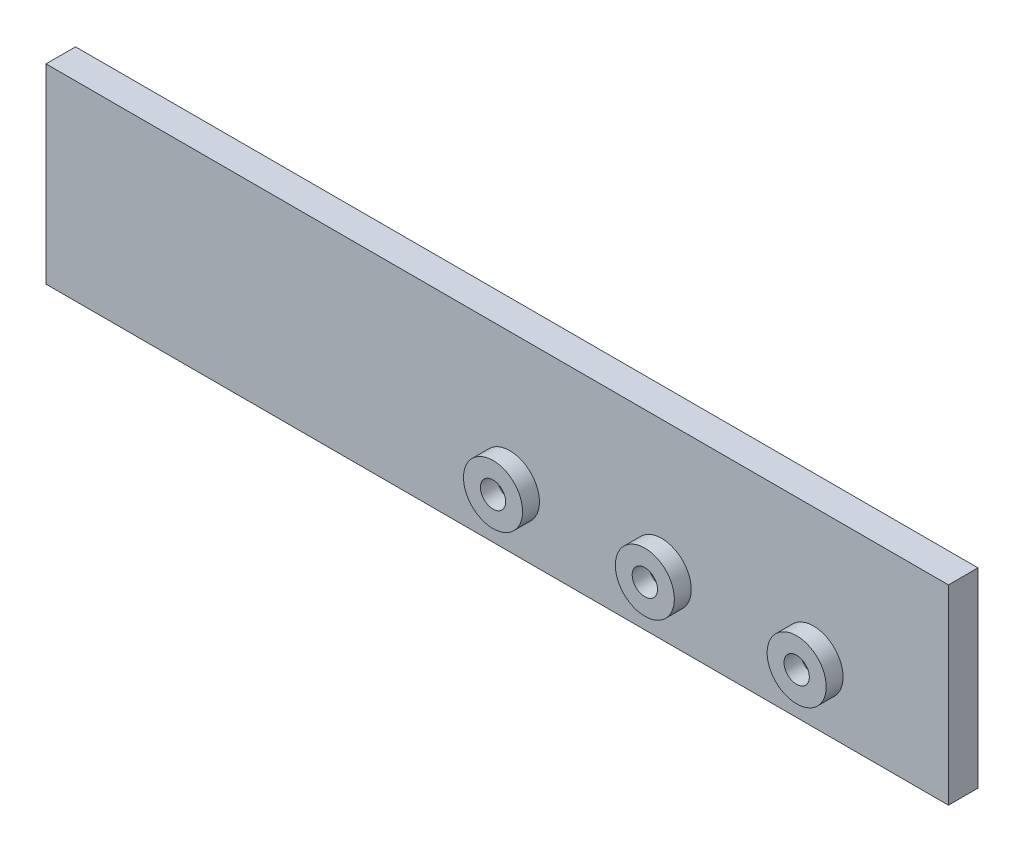
ISO-10303-21;
HEADER;
FILE_DESCRIPTION(('STEP AP214'),'2;1');
FILE_NAME('part.step','',(''),(''),'','','');
FILE_SCHEMA(('AUTOMOTIVE_DESIGN { 1 0 10303 214 1 1 1 1 }'));
ENDSEC;
DATA;
#1=APPLICATION_CONTEXT('core data for automotive mechanical design processes');
#2=APPLICATION_PROTOCOL_DEFINITION('international standard','automotive_design',2000,#1);
#3=PRODUCT_CONTEXT('',#1,'mechanical');
#4=PRODUCT('Part','Part','',(#3));
#5=PRODUCT_RELATED_PRODUCT_CATEGORY('part','',(#4));
#6=PRODUCT_DEFINITION_FORMATION('','',#4);
#7=PRODUCT_DEFINITION_CONTEXT('part definition',#1,'design');
#8=PRODUCT_DEFINITION('design','',#6,#7);
#9=PRODUCT_DEFINITION_SHAPE('','',#8);
#10=(LENGTH_UNIT() NAMED_UNIT(*) SI_UNIT(.MILLI.,.METRE.));
#11=(NAMED_UNIT(*) PLANE_ANGLE_UNIT() SI_UNIT($,.RADIAN.));
#12=(NAMED_UNIT(*) SI_UNIT($,.STERADIAN.) SOLID_ANGLE_UNIT());
#13=UNCERTAINTY_MEASURE_WITH_UNIT(LENGTH_MEASURE(1.E-05),#10,'distance_accuracy_value','');
#14=(GEOMETRIC_REPRESENTATION_CONTEXT(3) GLOBAL_UNCERTAINTY_ASSIGNED_CONTEXT((#13)) GLOBAL_UNIT_ASSIGNED_CONTEXT((#10,
#11,#12)) REPRESENTATION_CONTEXT('',''));
#15=CARTESIAN_POINT('',(0.,0.,0.));
#16=DIRECTION('',(0.,0.,1.));
#17=DIRECTION('',(1.,0.,0.));
#18=AXIS2_PLACEMENT_3D('',#15,#16,#17);
#19=CARTESIAN_POINT('',(0.,33.271694214876,3.5));
#20=DIRECTION('',(0.,1.,0.));
#21=DIRECTION('',(0.,0.,1.));
#22=AXIS2_PLACEMENT_3D('',#19,#20,#21);
#23=PLANE('',#22);
#24=DIRECTION('',(1.,0.,0.));
#25=VECTOR('',#24,1.);
#26=CARTESIAN_POINT('',(0.,33.271694214876,0.));
#27=LINE('',#26,#25);
#28=CARTESIAN_POINT('',(-40.6776859504132,33.271694214876,0.));
#29=VERTEX_POINT('',#28);
#30=CARTESIAN_POINT('',(66.3223140495868,33.271694214876,0.));
#31=VERTEX_POINT('',#30);
#32=EDGE_CURVE('E134',#29,#31,#27,.T.);
#33=ORIENTED_EDGE('',*,*,#32,.F.);
#34=DIRECTION('',(0.,0.,-1.));
#35=VECTOR('',#34,1.);
#36=CARTESIAN_POINT('',(-40.6776859504132,33.271694214876,3.5));
#37=LINE('',#36,#35);
#38=CARTESIAN_POINT('',(-40.6776859504132,33.271694214876,3.5));
#39=VERTEX_POINT('',#38);
#40=EDGE_CURVE('E129',#39,#29,#37,.T.);
#41=ORIENTED_EDGE('',*,*,#40,.F.);
#42=DIRECTION('',(1.,0.,0.));
#43=VECTOR('',#42,1.);
#44=CARTESIAN_POINT('',(0.,33.271694214876,3.5));
#45=LINE('',#44,#43);
#46=CARTESIAN_POINT('',(66.3223140495868,33.271694214876,3.5));
#47=VERTEX_POINT('',#46);
#48=EDGE_CURVE('E132',#39,#47,#45,.T.);
#49=ORIENTED_EDGE('',*,*,#48,.T.);
#50=DIRECTION('',(0.,0.,-1.));
#51=VECTOR('',#50,1.);
#52=CARTESIAN_POINT('',(66.3223140495868,33.271694214876,3.5));
#53=LINE('',#52,#51);
#54=EDGE_CURVE('E124',#47,#31,#53,.T.);
#55=ORIENTED_EDGE('',*,*,#54,.T.);
#56=EDGE_LOOP('',(#33,#41,#49,#55));
#57=FACE_BOUND('',#56,.T.);
#58=ADVANCED_FACE('F80',(#57),#23,.T.);
#59=CARTESIAN_POINT('',(-40.6776859504132,0.,3.5));
#60=DIRECTION('',(1.,0.,0.));
#61=DIRECTION('',(0.,1.,0.));
#62=AXIS2_PLACEMENT_3D('',#59,#60,#61);
#63=PLANE('',#62);
#64=DIRECTION('',(0.,-1.,0.));
#65=VECTOR('',#64,1.);
#66=CARTESIAN_POINT('',(-40.6776859504132,0.,0.));
#67=LINE('',#66,#65);
#68=CARTESIAN_POINT('',(-40.6776859504132,10.651694214876,0.));
#69=VERTEX_POINT('',#68);
#70=EDGE_CURVE('E154',#29,#69,#67,.T.);
#71=ORIENTED_EDGE('',*,*,#70,.T.);
#72=DIRECTION('',(0.,0.,-1.));
#73=VECTOR('',#72,1.);
#74=CARTESIAN_POINT('',(-40.6776859504132,10.651694214876,3.5));
#75=LINE('',#74,#73);
#76=CARTESIAN_POINT('',(-40.6776859504132,10.651694214876,3.5));
#77=VERTEX_POINT('',#76);
#78=EDGE_CURVE('E137',#77,#69,#75,.T.);
#79=ORIENTED_EDGE('',*,*,#78,.F.);
#80=DIRECTION('',(0.,-1.,0.));
#81=VECTOR('',#80,1.);
#82=CARTESIAN_POINT('',(-40.6776859504132,0.,3.5));
#83=LINE('',#82,#81);
#84=EDGE_CURVE('E140',#39,#77,#83,.T.);
#85=ORIENTED_EDGE('',*,*,#84,.F.);
#86=ORIENTED_EDGE('',*,*,#40,.T.);
#87=EDGE_LOOP('',(#71,#79,#85,#86));
#88=FACE_BOUND('',#87,.T.);
#89=ADVANCED_FACE('F141',(#88),#63,.F.);
#90=CARTESIAN_POINT('',(0.,10.651694214876,3.5));
#91=DIRECTION('',(0.,1.,0.));
#92=DIRECTION('',(0.,0.,1.));
#93=AXIS2_PLACEMENT_3D('',#90,#91,#92);
#94=PLANE('',#93);
#95=DIRECTION('',(1.,0.,0.));
#96=VECTOR('',#95,1.);
#97=CARTESIAN_POINT('',(0.,10.651694214876,0.));
#98=LINE('',#97,#96);
#99=CARTESIAN_POINT('',(66.3223140495868,10.651694214876,0.));
#100=VERTEX_POINT('',#99);
#101=EDGE_CURVE('E114',#69,#100,#98,.T.);
#102=ORIENTED_EDGE('',*,*,#101,.T.);
#103=DIRECTION('',(0.,0.,-1.));
#104=VECTOR('',#103,1.);
#105=CARTESIAN_POINT('',(66.3223140495868,10.651694214876,3.5));
#106=LINE('',#105,#104);
#107=CARTESIAN_POINT('',(66.3223140495868,10.651694214876,3.5));
#108=VERTEX_POINT('',#107);
#109=EDGE_CURVE('E121',#108,#100,#106,.T.);
#110=ORIENTED_EDGE('',*,*,#109,.F.);
#111=DIRECTION('',(1.,0.,0.));
#112=VECTOR('',#111,1.);
#113=CARTESIAN_POINT('',(0.,10.651694214876,3.5));
#114=LINE('',#113,#112);
#115=EDGE_CURVE('E97',#77,#108,#114,.T.);
#116=ORIENTED_EDGE('',*,*,#115,.F.);
#117=ORIENTED_EDGE('',*,*,#78,.T.);
#118=EDGE_LOOP('',(#102,#110,#116,#117));
#119=FACE_BOUND('',#118,.T.);
#120=ADVANCED_FACE('F223',(#119),#94,.F.);
#121=CARTESIAN_POINT('',(66.3223140495868,0.,3.5));
#122=DIRECTION('',(1.,0.,0.));
#123=DIRECTION('',(0.,1.,0.));
#124=AXIS2_PLACEMENT_3D('',#121,#122,#123);
#125=PLANE('',#124);
#126=DIRECTION('',(0.,-1.,0.));
#127=VECTOR('',#126,1.);
#128=CARTESIAN_POINT('',(66.3223140495868,0.,0.));
#129=LINE('',#128,#127);
#130=EDGE_CURVE('E150',#31,#100,#129,.T.);
#131=ORIENTED_EDGE('',*,*,#130,.F.);
#132=ORIENTED_EDGE('',*,*,#54,.F.);
#133=DIRECTION('',(0.,-1.,0.));
#134=VECTOR('',#133,1.);
#135=CARTESIAN_POINT('',(66.3223140495868,0.,3.5));
#136=LINE('',#135,#134);
#137=EDGE_CURVE('E144',#47,#108,#136,.T.);
#138=ORIENTED_EDGE('',*,*,#137,.T.);
#139=ORIENTED_EDGE('',*,*,#109,.T.);
#140=EDGE_LOOP('',(#131,#132,#138,#139));
#141=FACE_BOUND('',#140,.T.);
#142=ADVANCED_FACE('F82',(#141),#125,.T.);
#143=CARTESIAN_POINT('',(0.,0.,0.));
#144=DIRECTION('',(0.,0.,1.));
#145=DIRECTION('',(1.,0.,0.));
#146=AXIS2_PLACEMENT_3D('',#143,#144,#145);
#147=PLANE('',#146);
#148=ORIENTED_EDGE('',*,*,#130,.T.);
#149=ORIENTED_EDGE('',*,*,#101,.F.);
#150=ORIENTED_EDGE('',*,*,#70,.F.);
#151=ORIENTED_EDGE('',*,*,#32,.T.);
#152=EDGE_LOOP('',(#148,#149,#150,#151));
#153=FACE_BOUND('',#152,.T.);
#154=ADVANCED_FACE('F215',(#153),#147,.F.);
#155=CARTESIAN_POINT('',(0.,0.,3.5));
#156=DIRECTION('',(0.,0.,1.));
#157=DIRECTION('',(1.,0.,0.));
#158=AXIS2_PLACEMENT_3D('',#155,#156,#157);
#159=PLANE('',#158);
#160=CARTESIAN_POINT('',(50.3223140495868,17.551694214876,3.5));
#161=DIRECTION('',(0.,0.,1.));
#162=DIRECTION('',(1.,0.,0.));
#163=AXIS2_PLACEMENT_3D('',#160,#161,#162);
#164=CIRCLE('',#163,3.5);
#165=CARTESIAN_POINT('',(53.8223140495868,17.551694214876,3.5));
#166=VERTEX_POINT('',#165);
#167=EDGE_CURVE('E168',#166,#166,#164,.F.);
#168=ORIENTED_EDGE('',*,*,#167,.T.);
#169=EDGE_LOOP('',(#168));
#170=FACE_BOUND('',#169,.T.);
#171=CARTESIAN_POINT('',(32.3223140495868,17.551694214876,3.5));
#172=DIRECTION('',(0.,0.,1.));
#173=DIRECTION('',(1.,0.,0.));
#174=AXIS2_PLACEMENT_3D('',#171,#172,#173);
#175=CIRCLE('',#174,3.49999999999999);
#176=CARTESIAN_POINT('',(35.8223140495868,17.551694214876,3.5));
#177=VERTEX_POINT('',#176);
#178=EDGE_CURVE('E164',#177,#177,#175,.F.);
#179=ORIENTED_EDGE('',*,*,#178,.T.);
#180=EDGE_LOOP('',(#179));
#181=FACE_BOUND('',#180,.T.);
#182=CARTESIAN_POINT('',(14.3223140495868,17.551694214876,3.5));
#183=DIRECTION('',(0.,0.,1.));
#184=DIRECTION('',(1.,0.,0.));
#185=AXIS2_PLACEMENT_3D('',#182,#183,#184);
#186=CIRCLE('',#185,3.5);
#187=CARTESIAN_POINT('',(17.8223140495868,17.551694214876,3.5));
#188=VERTEX_POINT('',#187);
#189=EDGE_CURVE('E152',#188,#188,#186,.F.);
#190=ORIENTED_EDGE('',*,*,#189,.T.);
#191=EDGE_LOOP('',(#190));
#192=FACE_BOUND('',#191,.T.);
#193=ORIENTED_EDGE('',*,*,#137,.F.);
#194=ORIENTED_EDGE('',*,*,#48,.F.);
#195=ORIENTED_EDGE('',*,*,#84,.T.);
#196=ORIENTED_EDGE('',*,*,#115,.T.);
#197=EDGE_LOOP('',(#193,#194,#195,#196));
#198=FACE_BOUND('',#197,.T.);
#199=ADVANCED_FACE('F143',(#170,#181,#192,#198),#159,.T.);
#200=CARTESIAN_POINT('',(14.3223140495868,17.551694214876,5.5));
#201=DIRECTION('',(0.,0.,-1.));
#202=DIRECTION('',(-1.,0.,0.));
#203=AXIS2_PLACEMENT_3D('',#200,#201,#202);
#204=CYLINDRICAL_SURFACE('',#203,3.5);
#205=ORIENTED_EDGE('',*,*,#189,.F.);
#206=EDGE_LOOP('',(#205));
#207=FACE_BOUND('',#206,.T.);
#208=CARTESIAN_POINT('',(14.3223140495868,17.551694214876,5.5));
#209=DIRECTION('',(0.,0.,1.));
#210=DIRECTION('',(1.,0.,0.));
#211=AXIS2_PLACEMENT_3D('',#208,#209,#210);
#212=CIRCLE('',#211,3.5);
#213=CARTESIAN_POINT('',(17.8223140495868,17.551694214876,5.5));
#214=VERTEX_POINT('',#213);
#215=EDGE_CURVE('E163',#214,#214,#212,.T.);
#216=ORIENTED_EDGE('',*,*,#215,.F.);
#217=EDGE_LOOP('',(#216));
#218=FACE_BOUND('',#217,.T.);
#219=ADVANCED_FACE('F204',(#207,#218),#204,.T.);
#220=CARTESIAN_POINT('',(14.3223140495868,17.551694214876,5.5));
#221=DIRECTION('',(0.,0.,1.));
#222=DIRECTION('',(1.,0.,0.));
#223=AXIS2_PLACEMENT_3D('',#220,#221,#222);
#224=PLANE('',#223);
#225=CARTESIAN_POINT('',(14.3223140495868,17.551694214876,5.5));
#226=DIRECTION('',(0.,0.,1.));
#227=DIRECTION('',(1.,0.,0.));
#228=AXIS2_PLACEMENT_3D('',#225,#226,#227);
#229=CIRCLE('',#228,1.5);
#230=CARTESIAN_POINT('',(15.8223140495868,17.551694214876,5.5));
#231=VERTEX_POINT('',#230);
#232=EDGE_CURVE('E188',#231,#231,#229,.T.);
#233=ORIENTED_EDGE('',*,*,#232,.F.);
#234=EDGE_LOOP('',(#233));
#235=FACE_BOUND('',#234,.T.);
#236=ORIENTED_EDGE('',*,*,#215,.T.);
#237=EDGE_LOOP('',(#236));
#238=FACE_BOUND('',#237,.T.);
#239=ADVANCED_FACE('F202',(#235,#238),#224,.T.);
#240=CARTESIAN_POINT('',(32.3223140495868,17.551694214876,5.5));
#241=DIRECTION('',(0.,0.,-1.));
#242=DIRECTION('',(-1.,0.,0.));
#243=AXIS2_PLACEMENT_3D('',#240,#241,#242);
#244=CYLINDRICAL_SURFACE('',#243,3.49999999999999);
#245=ORIENTED_EDGE('',*,*,#178,.F.);
#246=EDGE_LOOP('',(#245));
#247=FACE_BOUND('',#246,.T.);
#248=CARTESIAN_POINT('',(32.3223140495868,17.551694214876,5.5));
#249=DIRECTION('',(0.,0.,1.));
#250=DIRECTION('',(1.,0.,0.));
#251=AXIS2_PLACEMENT_3D('',#248,#249,#250);
#252=CIRCLE('',#251,3.49999999999999);
#253=CARTESIAN_POINT('',(35.8223140495868,17.551694214876,5.5));
#254=VERTEX_POINT('',#253);
#255=EDGE_CURVE('E167',#254,#254,#252,.T.);
#256=ORIENTED_EDGE('',*,*,#255,.F.);
#257=EDGE_LOOP('',(#256));
#258=FACE_BOUND('',#257,.T.);
#259=ADVANCED_FACE('F212',(#247,#258),#244,.T.);
#260=CARTESIAN_POINT('',(32.3223140495868,17.551694214876,5.5));
#261=DIRECTION('',(0.,0.,1.));
#262=DIRECTION('',(1.,0.,0.));
#263=AXIS2_PLACEMENT_3D('',#260,#261,#262);
#264=PLANE('',#263);
#265=CARTESIAN_POINT('',(32.3223140495868,17.551694214876,5.5));
#266=DIRECTION('',(0.,0.,1.));
#267=DIRECTION('',(1.,0.,0.));
#268=AXIS2_PLACEMENT_3D('',#265,#266,#267);
#269=CIRCLE('',#268,1.5);
#270=CARTESIAN_POINT('',(33.8223140495868,17.551694214876,5.5));
#271=VERTEX_POINT('',#270);
#272=EDGE_CURVE('E186',#271,#271,#269,.T.);
#273=ORIENTED_EDGE('',*,*,#272,.F.);
#274=EDGE_LOOP('',(#273));
#275=FACE_BOUND('',#274,.T.);
#276=ORIENTED_EDGE('',*,*,#255,.T.);
#277=EDGE_LOOP('',(#276));
#278=FACE_BOUND('',#277,.T.);
#279=ADVANCED_FACE('F285',(#275,#278),#264,.T.);
#280=CARTESIAN_POINT('',(50.3223140495868,17.551694214876,5.5));
#281=DIRECTION('',(0.,0.,-1.));
#282=DIRECTION('',(-1.,0.,0.));
#283=AXIS2_PLACEMENT_3D('',#280,#281,#282);
#284=CYLINDRICAL_SURFACE('',#283,3.5);
#285=ORIENTED_EDGE('',*,*,#167,.F.);
#286=EDGE_LOOP('',(#285));
#287=FACE_BOUND('',#286,.T.);
#288=CARTESIAN_POINT('',(50.3223140495868,17.551694214876,5.5));
#289=DIRECTION('',(0.,0.,1.));
#290=DIRECTION('',(1.,0.,0.));
#291=AXIS2_PLACEMENT_3D('',#288,#289,#290);
#292=CIRCLE('',#291,3.5);
#293=CARTESIAN_POINT('',(53.8223140495868,17.551694214876,5.5));
#294=VERTEX_POINT('',#293);
#295=EDGE_CURVE('E171',#294,#294,#292,.T.);
#296=ORIENTED_EDGE('',*,*,#295,.F.);
#297=EDGE_LOOP('',(#296));
#298=FACE_BOUND('',#297,.T.);
#299=ADVANCED_FACE('F293',(#287,#298),#284,.T.);
#300=CARTESIAN_POINT('',(50.3223140495868,17.551694214876,5.5));
#301=DIRECTION('',(0.,0.,1.));
#302=DIRECTION('',(1.,0.,0.));
#303=AXIS2_PLACEMENT_3D('',#300,#301,#302);
#304=PLANE('',#303);
#305=CARTESIAN_POINT('',(50.3223140495868,17.551694214876,5.5));
#306=DIRECTION('',(0.,0.,1.));
#307=DIRECTION('',(1.,0.,0.));
#308=AXIS2_PLACEMENT_3D('',#305,#306,#307);
#309=CIRCLE('',#308,1.5);
#310=CARTESIAN_POINT('',(51.8223140495868,17.551694214876,5.5));
#311=VERTEX_POINT('',#310);
#312=EDGE_CURVE('E189',#311,#311,#309,.T.);
#313=ORIENTED_EDGE('',*,*,#312,.F.);
#314=EDGE_LOOP('',(#313));
#315=FACE_BOUND('',#314,.T.);
#316=ORIENTED_EDGE('',*,*,#295,.T.);
#317=EDGE_LOOP('',(#316));
#318=FACE_BOUND('',#317,.T.);
#319=ADVANCED_FACE('F301',(#315,#318),#304,.T.);
#320=CARTESIAN_POINT('',(14.3223140495868,17.551694214876,5.5));
#321=DIRECTION('',(0.,0.,-1.));
#322=DIRECTION('',(-1.,0.,0.));
#323=AXIS2_PLACEMENT_3D('',#320,#321,#322);
#324=CYLINDRICAL_SURFACE('',#323,1.5);
#325=CARTESIAN_POINT('',(14.3223140495868,17.551694214876,3.5));
#326=DIRECTION('',(0.,0.,1.));
#327=DIRECTION('',(1.,0.,0.));
#328=AXIS2_PLACEMENT_3D('',#325,#326,#327);
#329=CIRCLE('',#328,1.5);
#330=CARTESIAN_POINT('',(15.8223140495868,17.551694214876,3.5));
#331=VERTEX_POINT('',#330);
#332=EDGE_CURVE('E160',#331,#331,#329,.T.);
#333=ORIENTED_EDGE('',*,*,#332,.F.);
#334=EDGE_LOOP('',(#333));
#335=FACE_BOUND('',#334,.T.);
#336=ORIENTED_EDGE('',*,*,#232,.T.);
#337=EDGE_LOOP('',(#336));
#338=FACE_BOUND('',#337,.T.);
#339=ADVANCED_FACE('F309',(#335,#338),#324,.F.);
#340=CARTESIAN_POINT('',(50.3223140495868,17.551694214876,5.5));
#341=DIRECTION('',(0.,0.,-1.));
#342=DIRECTION('',(-1.,0.,0.));
#343=AXIS2_PLACEMENT_3D('',#340,#341,#342);
#344=CYLINDRICAL_SURFACE('',#343,1.5);
#345=CARTESIAN_POINT('',(50.3223140495868,17.551694214876,3.5));
#346=DIRECTION('',(0.,0.,1.));
#347=DIRECTION('',(1.,0.,0.));
#348=AXIS2_PLACEMENT_3D('',#345,#346,#347);
#349=CIRCLE('',#348,1.5);
#350=CARTESIAN_POINT('',(51.8223140495868,17.551694214876,3.5));
#351=VERTEX_POINT('',#350);
#352=EDGE_CURVE('E12',#351,#351,#349,.T.);
#353=ORIENTED_EDGE('',*,*,#352,.F.);
#354=EDGE_LOOP('',(#353));
#355=FACE_BOUND('',#354,.T.);
#356=ORIENTED_EDGE('',*,*,#312,.T.);
#357=EDGE_LOOP('',(#356));
#358=FACE_BOUND('',#357,.T.);
#359=ADVANCED_FACE('F182',(#355,#358),#344,.F.);
#360=CARTESIAN_POINT('',(32.3223140495868,17.551694214876,5.5));
#361=DIRECTION('',(0.,0.,-1.));
#362=DIRECTION('',(-1.,0.,0.));
#363=AXIS2_PLACEMENT_3D('',#360,#361,#362);
#364=CYLINDRICAL_SURFACE('',#363,1.5);
#365=CARTESIAN_POINT('',(32.3223140495868,17.551694214876,3.5));
#366=DIRECTION('',(0.,0.,1.));
#367=DIRECTION('',(1.,0.,0.));
#368=AXIS2_PLACEMENT_3D('',#365,#366,#367);
#369=CIRCLE('',#368,1.5);
#370=CARTESIAN_POINT('',(33.8223140495868,17.551694214876,3.5));
#371=VERTEX_POINT('',#370);
#372=EDGE_CURVE('E89',#371,#371,#369,.T.);
#373=ORIENTED_EDGE('',*,*,#372,.F.);
#374=EDGE_LOOP('',(#373));
#375=FACE_BOUND('',#374,.T.);
#376=ORIENTED_EDGE('',*,*,#272,.T.);
#377=EDGE_LOOP('',(#376));
#378=FACE_BOUND('',#377,.T.);
#379=ADVANCED_FACE('F178',(#375,#378),#364,.F.);
#380=CARTESIAN_POINT('',(14.3223140495868,17.551694214876,3.5));
#381=DIRECTION('',(0.,0.,1.));
#382=DIRECTION('',(1.,0.,0.));
#383=AXIS2_PLACEMENT_3D('',#380,#381,#382);
#384=PLANE('',#383);
#385=ORIENTED_EDGE('',*,*,#332,.T.);
#386=EDGE_LOOP('',(#385));
#387=FACE_BOUND('',#386,.T.);
#388=ADVANCED_FACE('F181',(#387),#384,.T.);
#389=CARTESIAN_POINT('',(32.3223140495868,17.551694214876,3.5));
#390=DIRECTION('',(0.,0.,1.));
#391=DIRECTION('',(1.,0.,0.));
#392=AXIS2_PLACEMENT_3D('',#389,#390,#391);
#393=PLANE('',#392);
#394=ORIENTED_EDGE('',*,*,#372,.T.);
#395=EDGE_LOOP('',(#394));
#396=FACE_BOUND('',#395,.T.);
#397=ADVANCED_FACE('F176',(#396),#393,.T.);
#398=CARTESIAN_POINT('',(50.3223140495868,17.551694214876,3.5));
#399=DIRECTION('',(0.,0.,1.));
#400=DIRECTION('',(1.,0.,0.));
#401=AXIS2_PLACEMENT_3D('',#398,#399,#400);
#402=PLANE('',#401);
#403=ORIENTED_EDGE('',*,*,#352,.T.);
#404=EDGE_LOOP('',(#403));
#405=FACE_BOUND('',#404,.T.);
#406=ADVANCED_FACE('F348',(#405),#402,.T.);
#407=CLOSED_SHELL('',(#58,#89,#120,#142,#154,#199,#219,#239,#259,#279,#299,#319,#339,#359,#379,
#388,#397,#406));
#408=MANIFOLD_SOLID_BREP('B2',#407);
#409=ADVANCED_BREP_SHAPE_REPRESENTATION('',(#18,#408),#14);
#410=SHAPE_DEFINITION_REPRESENTATION(#9,#409);
ENDSEC;
END-ISO-10303-21;
